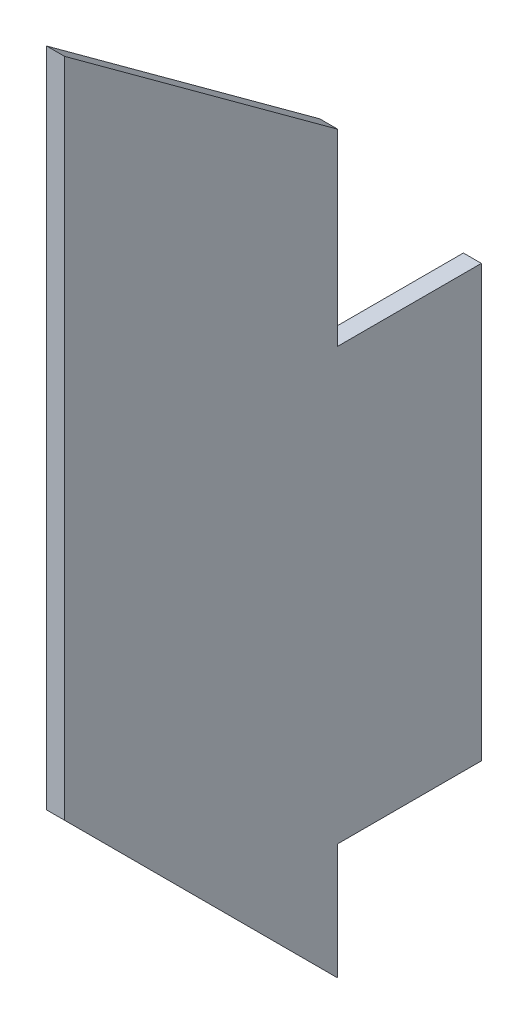
ISO-10303-21;
HEADER;
FILE_DESCRIPTION(('STEP AP214'),'2;1');
FILE_NAME('part.step','',(''),(''),'','','');
FILE_SCHEMA(('AUTOMOTIVE_DESIGN { 1 0 10303 214 1 1 1 1 }'));
ENDSEC;
DATA;
#1=APPLICATION_CONTEXT('core data for automotive mechanical design processes');
#2=APPLICATION_PROTOCOL_DEFINITION('international standard','automotive_design',2000,#1);
#3=PRODUCT_CONTEXT('',#1,'mechanical');
#4=PRODUCT('Part','Part','',(#3));
#5=PRODUCT_RELATED_PRODUCT_CATEGORY('part','',(#4));
#6=PRODUCT_DEFINITION_FORMATION('','',#4);
#7=PRODUCT_DEFINITION_CONTEXT('part definition',#1,'design');
#8=PRODUCT_DEFINITION('design','',#6,#7);
#9=PRODUCT_DEFINITION_SHAPE('','',#8);
#10=(LENGTH_UNIT() NAMED_UNIT(*) SI_UNIT(.MILLI.,.METRE.));
#11=(NAMED_UNIT(*) PLANE_ANGLE_UNIT() SI_UNIT($,.RADIAN.));
#12=(NAMED_UNIT(*) SI_UNIT($,.STERADIAN.) SOLID_ANGLE_UNIT());
#13=UNCERTAINTY_MEASURE_WITH_UNIT(LENGTH_MEASURE(1.E-05),#10,'distance_accuracy_value','');
#14=(GEOMETRIC_REPRESENTATION_CONTEXT(3) GLOBAL_UNCERTAINTY_ASSIGNED_CONTEXT((#13)) GLOBAL_UNIT_ASSIGNED_CONTEXT((#10,
#11,#12)) REPRESENTATION_CONTEXT('',''));
#15=CARTESIAN_POINT('',(0.,0.,0.));
#16=DIRECTION('',(0.,0.,1.));
#17=DIRECTION('',(1.,0.,0.));
#18=AXIS2_PLACEMENT_3D('',#15,#16,#17);
#19=CARTESIAN_POINT('',(3.18,0.,0.));
#20=DIRECTION('',(0.,0.,1.));
#21=DIRECTION('',(0.,-1.,0.));
#22=AXIS2_PLACEMENT_3D('',#19,#20,#21);
#23=PLANE('',#22);
#24=DIRECTION('',(0.,1.,0.));
#25=VECTOR('',#24,1.);
#26=CARTESIAN_POINT('',(0.,0.,0.));
#27=LINE('',#26,#25);
#28=CARTESIAN_POINT('',(0.,0.,0.));
#29=VERTEX_POINT('',#28);
#30=CARTESIAN_POINT('',(0.,20.55,0.));
#31=VERTEX_POINT('',#30);
#32=EDGE_CURVE('E135',#29,#31,#27,.T.);
#33=ORIENTED_EDGE('',*,*,#32,.T.);
#34=DIRECTION('',(-1.,0.,0.));
#35=VECTOR('',#34,1.);
#36=CARTESIAN_POINT('',(3.18,20.55,0.));
#37=LINE('',#36,#35);
#38=CARTESIAN_POINT('',(3.18,20.55,0.));
#39=VERTEX_POINT('',#38);
#40=EDGE_CURVE('E11',#39,#31,#37,.T.);
#41=ORIENTED_EDGE('',*,*,#40,.F.);
#42=DIRECTION('',(0.,1.,0.));
#43=VECTOR('',#42,1.);
#44=CARTESIAN_POINT('',(3.18,0.,0.));
#45=LINE('',#44,#43);
#46=CARTESIAN_POINT('',(3.18,0.,0.));
#47=VERTEX_POINT('',#46);
#48=EDGE_CURVE('E149',#47,#39,#45,.T.);
#49=ORIENTED_EDGE('',*,*,#48,.F.);
#50=DIRECTION('',(-1.,0.,0.));
#51=VECTOR('',#50,1.);
#52=CARTESIAN_POINT('',(3.18,0.,0.));
#53=LINE('',#52,#51);
#54=EDGE_CURVE('E131',#47,#29,#53,.T.);
#55=ORIENTED_EDGE('',*,*,#54,.T.);
#56=EDGE_LOOP('',(#33,#41,#49,#55));
#57=FACE_BOUND('',#56,.T.);
#58=ADVANCED_FACE('F39',(#57),#23,.F.);
#59=CARTESIAN_POINT('',(3.18,20.55,0.));
#60=DIRECTION('',(0.,1.,0.));
#61=DIRECTION('',(0.,0.,1.));
#62=AXIS2_PLACEMENT_3D('',#59,#60,#61);
#63=PLANE('',#62);
#64=DIRECTION('',(0.,0.,-1.));
#65=VECTOR('',#64,1.);
#66=CARTESIAN_POINT('',(0.,20.55,0.));
#67=LINE('',#66,#65);
#68=CARTESIAN_POINT('',(0.,20.55,-25.4));
#69=VERTEX_POINT('',#68);
#70=EDGE_CURVE('E138',#31,#69,#67,.T.);
#71=ORIENTED_EDGE('',*,*,#70,.T.);
#72=DIRECTION('',(-1.,0.,0.));
#73=VECTOR('',#72,1.);
#74=CARTESIAN_POINT('',(3.18,20.55,-25.4));
#75=LINE('',#74,#73);
#76=CARTESIAN_POINT('',(3.18,20.55,-25.4));
#77=VERTEX_POINT('',#76);
#78=EDGE_CURVE('E47',#77,#69,#75,.T.);
#79=ORIENTED_EDGE('',*,*,#78,.F.);
#80=DIRECTION('',(0.,0.,-1.));
#81=VECTOR('',#80,1.);
#82=CARTESIAN_POINT('',(3.18,20.55,0.));
#83=LINE('',#82,#81);
#84=EDGE_CURVE('E98',#39,#77,#83,.T.);
#85=ORIENTED_EDGE('',*,*,#84,.F.);
#86=ORIENTED_EDGE('',*,*,#40,.T.);
#87=EDGE_LOOP('',(#71,#79,#85,#86));
#88=FACE_BOUND('',#87,.T.);
#89=ADVANCED_FACE('F184',(#88),#63,.F.);
#90=CARTESIAN_POINT('',(3.18,20.55,-25.4));
#91=DIRECTION('',(0.,0.,1.));
#92=DIRECTION('',(1.,0.,0.));
#93=AXIS2_PLACEMENT_3D('',#90,#91,#92);
#94=PLANE('',#93);
#95=DIRECTION('',(0.,1.,0.));
#96=VECTOR('',#95,1.);
#97=CARTESIAN_POINT('',(0.,20.55,-25.4));
#98=LINE('',#97,#96);
#99=CARTESIAN_POINT('',(0.,96.75,-25.4));
#100=VERTEX_POINT('',#99);
#101=EDGE_CURVE('E140',#69,#100,#98,.T.);
#102=ORIENTED_EDGE('',*,*,#101,.T.);
#103=DIRECTION('',(-1.,0.,0.));
#104=VECTOR('',#103,1.);
#105=CARTESIAN_POINT('',(3.18,96.75,-25.4));
#106=LINE('',#105,#104);
#107=CARTESIAN_POINT('',(3.18,96.75,-25.4));
#108=VERTEX_POINT('',#107);
#109=EDGE_CURVE('E156',#108,#100,#106,.T.);
#110=ORIENTED_EDGE('',*,*,#109,.F.);
#111=DIRECTION('',(0.,1.,0.));
#112=VECTOR('',#111,1.);
#113=CARTESIAN_POINT('',(3.18,20.55,-25.4));
#114=LINE('',#113,#112);
#115=EDGE_CURVE('E164',#77,#108,#114,.T.);
#116=ORIENTED_EDGE('',*,*,#115,.F.);
#117=ORIENTED_EDGE('',*,*,#78,.T.);
#118=EDGE_LOOP('',(#102,#110,#116,#117));
#119=FACE_BOUND('',#118,.T.);
#120=ADVANCED_FACE('F162',(#119),#94,.F.);
#121=CARTESIAN_POINT('',(3.18,96.75,-25.4));
#122=DIRECTION('',(0.,-1.,0.));
#123=DIRECTION('',(0.,0.,-1.));
#124=AXIS2_PLACEMENT_3D('',#121,#122,#123);
#125=PLANE('',#124);
#126=DIRECTION('',(0.,0.,1.));
#127=VECTOR('',#126,1.);
#128=CARTESIAN_POINT('',(0.,96.75,-25.4));
#129=LINE('',#128,#127);
#130=CARTESIAN_POINT('',(0.,96.75,0.));
#131=VERTEX_POINT('',#130);
#132=EDGE_CURVE('E142',#100,#131,#129,.T.);
#133=ORIENTED_EDGE('',*,*,#132,.T.);
#134=DIRECTION('',(-1.,0.,0.));
#135=VECTOR('',#134,1.);
#136=CARTESIAN_POINT('',(3.18,96.75,0.));
#137=LINE('',#136,#135);
#138=CARTESIAN_POINT('',(3.18,96.75,0.));
#139=VERTEX_POINT('',#138);
#140=EDGE_CURVE('E153',#139,#131,#137,.T.);
#141=ORIENTED_EDGE('',*,*,#140,.F.);
#142=DIRECTION('',(0.,0.,1.));
#143=VECTOR('',#142,1.);
#144=CARTESIAN_POINT('',(3.18,96.75,-25.4));
#145=LINE('',#144,#143);
#146=EDGE_CURVE('E176',#108,#139,#145,.T.);
#147=ORIENTED_EDGE('',*,*,#146,.F.);
#148=ORIENTED_EDGE('',*,*,#109,.T.);
#149=EDGE_LOOP('',(#133,#141,#147,#148));
#150=FACE_BOUND('',#149,.T.);
#151=ADVANCED_FACE('F172',(#150),#125,.F.);
#152=CARTESIAN_POINT('',(3.18,96.75,0.));
#153=DIRECTION('',(0.,0.,1.));
#154=DIRECTION('',(1.,0.,0.));
#155=AXIS2_PLACEMENT_3D('',#152,#153,#154);
#156=PLANE('',#155);
#157=DIRECTION('',(0.,1.,0.));
#158=VECTOR('',#157,1.);
#159=CARTESIAN_POINT('',(0.,96.75,0.));
#160=LINE('',#159,#158);
#161=CARTESIAN_POINT('',(0.,130.,0.));
#162=VERTEX_POINT('',#161);
#163=EDGE_CURVE('E144',#131,#162,#160,.T.);
#164=ORIENTED_EDGE('',*,*,#163,.T.);
#165=DIRECTION('',(-1.,0.,0.));
#166=VECTOR('',#165,1.);
#167=CARTESIAN_POINT('',(3.18,130.,0.));
#168=LINE('',#167,#166);
#169=CARTESIAN_POINT('',(3.18,130.,0.));
#170=VERTEX_POINT('',#169);
#171=EDGE_CURVE('E126',#170,#162,#168,.T.);
#172=ORIENTED_EDGE('',*,*,#171,.F.);
#173=DIRECTION('',(0.,1.,0.));
#174=VECTOR('',#173,1.);
#175=CARTESIAN_POINT('',(3.18,96.75,0.));
#176=LINE('',#175,#174);
#177=EDGE_CURVE('E117',#139,#170,#176,.T.);
#178=ORIENTED_EDGE('',*,*,#177,.F.);
#179=ORIENTED_EDGE('',*,*,#140,.T.);
#180=EDGE_LOOP('',(#164,#172,#178,#179));
#181=FACE_BOUND('',#180,.T.);
#182=ADVANCED_FACE('F175',(#181),#156,.F.);
#183=CARTESIAN_POINT('',(3.18,165.3,48.3));
#184=DIRECTION('',(0.,-0.807360494822477,0.590058498286403));
#185=DIRECTION('',(0.,-0.590058498286403,-0.807360494822477));
#186=AXIS2_PLACEMENT_3D('',#183,#184,#185);
#187=PLANE('',#186);
#188=DIRECTION('',(0.,0.590058498286403,0.807360494822477));
#189=VECTOR('',#188,1.);
#190=CARTESIAN_POINT('',(0.,165.3,48.3));
#191=LINE('',#190,#189);
#192=CARTESIAN_POINT('',(0.,165.3,48.3));
#193=VERTEX_POINT('',#192);
#194=EDGE_CURVE('E125',#162,#193,#191,.T.);
#195=ORIENTED_EDGE('',*,*,#194,.T.);
#196=DIRECTION('',(-1.,0.,0.));
#197=VECTOR('',#196,1.);
#198=CARTESIAN_POINT('',(3.18,165.3,48.3));
#199=LINE('',#198,#197);
#200=CARTESIAN_POINT('',(3.18,165.3,48.3));
#201=VERTEX_POINT('',#200);
#202=EDGE_CURVE('E122',#201,#193,#199,.T.);
#203=ORIENTED_EDGE('',*,*,#202,.F.);
#204=DIRECTION('',(0.,0.590058498286403,0.807360494822477));
#205=VECTOR('',#204,1.);
#206=CARTESIAN_POINT('',(3.18,165.3,48.3));
#207=LINE('',#206,#205);
#208=EDGE_CURVE('E111',#170,#201,#207,.T.);
#209=ORIENTED_EDGE('',*,*,#208,.F.);
#210=ORIENTED_EDGE('',*,*,#171,.T.);
#211=EDGE_LOOP('',(#195,#203,#209,#210));
#212=FACE_BOUND('',#211,.T.);
#213=ADVANCED_FACE('F123',(#212),#187,.F.);
#214=CARTESIAN_POINT('',(3.18,48.2999999999998,48.3));
#215=DIRECTION('',(0.,0.,-1.));
#216=DIRECTION('',(0.,1.,0.));
#217=AXIS2_PLACEMENT_3D('',#214,#215,#216);
#218=PLANE('',#217);
#219=DIRECTION('',(0.,-1.,0.));
#220=VECTOR('',#219,1.);
#221=CARTESIAN_POINT('',(0.,48.2999999999998,48.3));
#222=LINE('',#221,#220);
#223=CARTESIAN_POINT('',(0.,48.2999999999998,48.3));
#224=VERTEX_POINT('',#223);
#225=EDGE_CURVE('E84',#193,#224,#222,.T.);
#226=ORIENTED_EDGE('',*,*,#225,.T.);
#227=DIRECTION('',(-1.,0.,0.));
#228=VECTOR('',#227,1.);
#229=CARTESIAN_POINT('',(3.18,48.2999999999998,48.3));
#230=LINE('',#229,#228);
#231=CARTESIAN_POINT('',(3.18,48.2999999999998,48.3));
#232=VERTEX_POINT('',#231);
#233=EDGE_CURVE('E127',#232,#224,#230,.T.);
#234=ORIENTED_EDGE('',*,*,#233,.F.);
#235=DIRECTION('',(0.,-1.,0.));
#236=VECTOR('',#235,1.);
#237=CARTESIAN_POINT('',(3.18,48.2999999999998,48.3));
#238=LINE('',#237,#236);
#239=EDGE_CURVE('E115',#201,#232,#238,.T.);
#240=ORIENTED_EDGE('',*,*,#239,.F.);
#241=ORIENTED_EDGE('',*,*,#202,.T.);
#242=EDGE_LOOP('',(#226,#234,#240,#241));
#243=FACE_BOUND('',#242,.T.);
#244=ADVANCED_FACE('F129',(#243),#218,.F.);
#245=CARTESIAN_POINT('',(3.18,0.,0.));
#246=DIRECTION('',(0.,0.707106781186549,-0.707106781186546));
#247=DIRECTION('',(0.,0.707106781186546,0.707106781186549));
#248=AXIS2_PLACEMENT_3D('',#245,#246,#247);
#249=PLANE('',#248);
#250=DIRECTION('',(0.,-0.707106781186546,-0.707106781186549));
#251=VECTOR('',#250,1.);
#252=CARTESIAN_POINT('',(0.,0.,0.));
#253=LINE('',#252,#251);
#254=EDGE_CURVE('E90',#224,#29,#253,.T.);
#255=ORIENTED_EDGE('',*,*,#254,.T.);
#256=ORIENTED_EDGE('',*,*,#54,.F.);
#257=DIRECTION('',(0.,-0.707106781186546,-0.707106781186549));
#258=VECTOR('',#257,1.);
#259=CARTESIAN_POINT('',(3.18,0.,0.));
#260=LINE('',#259,#258);
#261=EDGE_CURVE('E55',#232,#47,#260,.T.);
#262=ORIENTED_EDGE('',*,*,#261,.F.);
#263=ORIENTED_EDGE('',*,*,#233,.T.);
#264=EDGE_LOOP('',(#255,#256,#262,#263));
#265=FACE_BOUND('',#264,.T.);
#266=ADVANCED_FACE('F200',(#265),#249,.F.);
#267=CARTESIAN_POINT('',(3.18,0.,0.));
#268=DIRECTION('',(-1.,0.,0.));
#269=DIRECTION('',(0.,0.,1.));
#270=AXIS2_PLACEMENT_3D('',#267,#268,#269);
#271=PLANE('',#270);
#272=ORIENTED_EDGE('',*,*,#48,.T.);
#273=ORIENTED_EDGE('',*,*,#84,.T.);
#274=ORIENTED_EDGE('',*,*,#115,.T.);
#275=ORIENTED_EDGE('',*,*,#146,.T.);
#276=ORIENTED_EDGE('',*,*,#177,.T.);
#277=ORIENTED_EDGE('',*,*,#208,.T.);
#278=ORIENTED_EDGE('',*,*,#239,.T.);
#279=ORIENTED_EDGE('',*,*,#261,.T.);
#280=EDGE_LOOP('',(#272,#273,#274,#275,#276,#277,#278,#279));
#281=FACE_BOUND('',#280,.T.);
#282=ADVANCED_FACE('F113',(#281),#271,.F.);
#283=CARTESIAN_POINT('',(0.,0.,0.));
#284=DIRECTION('',(-1.,0.,0.));
#285=DIRECTION('',(0.,0.,1.));
#286=AXIS2_PLACEMENT_3D('',#283,#284,#285);
#287=PLANE('',#286);
#288=ORIENTED_EDGE('',*,*,#32,.F.);
#289=ORIENTED_EDGE('',*,*,#254,.F.);
#290=ORIENTED_EDGE('',*,*,#225,.F.);
#291=ORIENTED_EDGE('',*,*,#194,.F.);
#292=ORIENTED_EDGE('',*,*,#163,.F.);
#293=ORIENTED_EDGE('',*,*,#132,.F.);
#294=ORIENTED_EDGE('',*,*,#101,.F.);
#295=ORIENTED_EDGE('',*,*,#70,.F.);
#296=EDGE_LOOP('',(#288,#289,#290,#291,#292,#293,#294,#295));
#297=FACE_BOUND('',#296,.T.);
#298=ADVANCED_FACE('F168',(#297),#287,.T.);
#299=CLOSED_SHELL('',(#58,#89,#120,#151,#182,#213,#244,#266,#282,#298));
#300=MANIFOLD_SOLID_BREP('B2',#299);
#301=ADVANCED_BREP_SHAPE_REPRESENTATION('',(#18,#300),#14);
#302=SHAPE_DEFINITION_REPRESENTATION(#9,#301);
ENDSEC;
END-ISO-10303-21;
